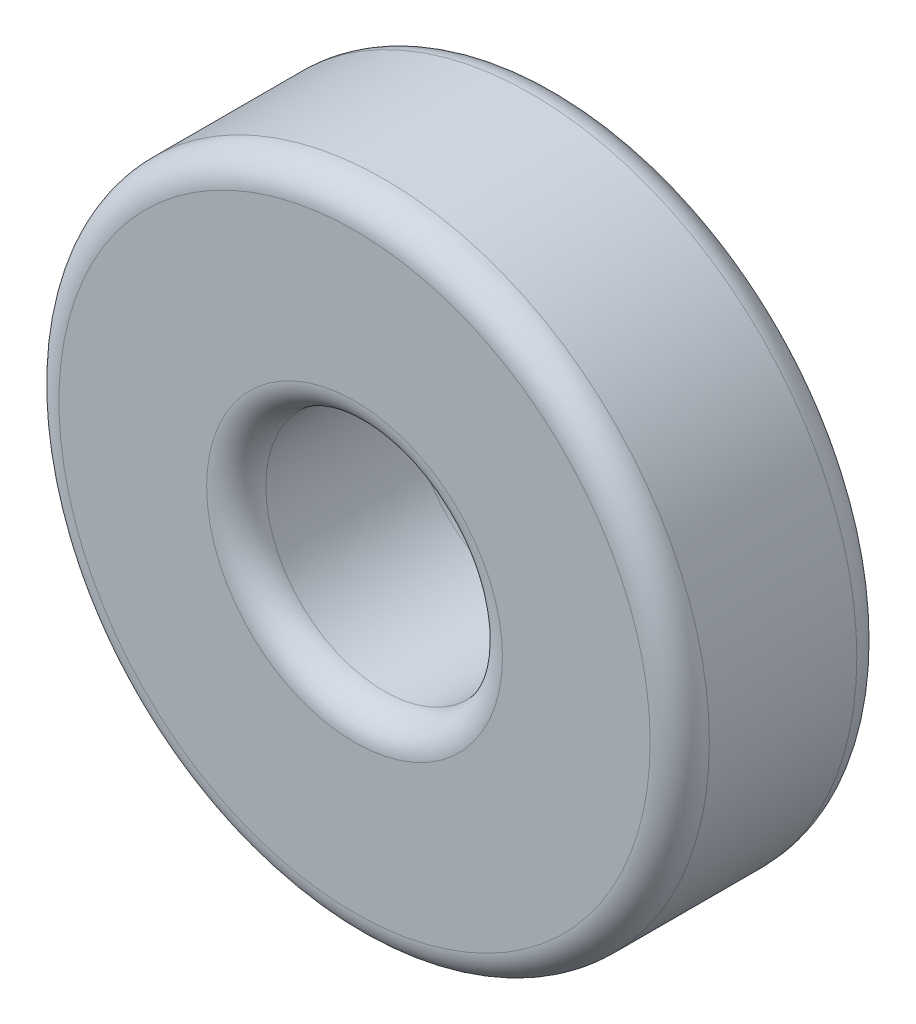
ISO-10303-21;
HEADER;
FILE_DESCRIPTION(('STEP AP214'),'2;1');
FILE_NAME('part.step','',(''),(''),'','','');
FILE_SCHEMA(('AUTOMOTIVE_DESIGN { 1 0 10303 214 1 1 1 1 }'));
ENDSEC;
DATA;
#1=APPLICATION_CONTEXT('core data for automotive mechanical design processes');
#2=APPLICATION_PROTOCOL_DEFINITION('international standard','automotive_design',2000,#1);
#3=PRODUCT_CONTEXT('',#1,'mechanical');
#4=PRODUCT('Part','Part','',(#3));
#5=PRODUCT_RELATED_PRODUCT_CATEGORY('part','',(#4));
#6=PRODUCT_DEFINITION_FORMATION('','',#4);
#7=PRODUCT_DEFINITION_CONTEXT('part definition',#1,'design');
#8=PRODUCT_DEFINITION('design','',#6,#7);
#9=PRODUCT_DEFINITION_SHAPE('','',#8);
#10=(LENGTH_UNIT() NAMED_UNIT(*) SI_UNIT(.MILLI.,.METRE.));
#11=(NAMED_UNIT(*) PLANE_ANGLE_UNIT() SI_UNIT($,.RADIAN.));
#12=(NAMED_UNIT(*) SI_UNIT($,.STERADIAN.) SOLID_ANGLE_UNIT());
#13=UNCERTAINTY_MEASURE_WITH_UNIT(LENGTH_MEASURE(1.E-05),#10,'distance_accuracy_value','');
#14=(GEOMETRIC_REPRESENTATION_CONTEXT(3) GLOBAL_UNCERTAINTY_ASSIGNED_CONTEXT((#13)) GLOBAL_UNIT_ASSIGNED_CONTEXT((#10,
#11,#12)) REPRESENTATION_CONTEXT('',''));
#15=CARTESIAN_POINT('',(0.,0.,0.));
#16=DIRECTION('',(0.,0.,1.));
#17=DIRECTION('',(1.,0.,0.));
#18=AXIS2_PLACEMENT_3D('',#15,#16,#17);
#19=CARTESIAN_POINT('',(0.,0.,6.985));
#20=DIRECTION('',(0.,0.,1.));
#21=DIRECTION('',(1.,0.,0.));
#22=AXIS2_PLACEMENT_3D('',#19,#20,#21);
#23=PLANE('',#22);
#24=CARTESIAN_POINT('',(0.,0.,6.985));
#25=DIRECTION('',(0.,0.,1.));
#26=DIRECTION('',(1.,0.,0.));
#27=AXIS2_PLACEMENT_3D('',#24,#25,#26);
#28=CIRCLE('',#27,5.);
#29=CARTESIAN_POINT('',(5.,0.,6.985));
#30=VERTEX_POINT('',#29);
#31=EDGE_CURVE('E42',#30,#30,#28,.F.);
#32=ORIENTED_EDGE('',*,*,#31,.T.);
#33=EDGE_LOOP('',(#32));
#34=FACE_BOUND('',#33,.T.);
#35=CARTESIAN_POINT('',(0.,0.,6.985));
#36=DIRECTION('',(0.,0.,1.));
#37=DIRECTION('',(1.,0.,0.));
#38=AXIS2_PLACEMENT_3D('',#35,#36,#37);
#39=CIRCLE('',#38,9.99185);
#40=CARTESIAN_POINT('',(9.99185,0.,6.985));
#41=VERTEX_POINT('',#40);
#42=EDGE_CURVE('E46',#41,#41,#39,.T.);
#43=ORIENTED_EDGE('',*,*,#42,.T.);
#44=EDGE_LOOP('',(#43));
#45=FACE_BOUND('',#44,.T.);
#46=ADVANCED_FACE('F31',(#34,#45),#23,.T.);
#47=CARTESIAN_POINT('',(0.,0.,0.));
#48=DIRECTION('',(0.,0.,1.));
#49=DIRECTION('',(1.,0.,0.));
#50=AXIS2_PLACEMENT_3D('',#47,#48,#49);
#51=PLANE('',#50);
#52=CARTESIAN_POINT('',(0.,0.,0.));
#53=DIRECTION('',(0.,0.,1.));
#54=DIRECTION('',(1.,0.,0.));
#55=AXIS2_PLACEMENT_3D('',#52,#53,#54);
#56=CIRCLE('',#55,5.);
#57=CARTESIAN_POINT('',(5.,0.,0.));
#58=VERTEX_POINT('',#57);
#59=EDGE_CURVE('E57',#58,#58,#56,.T.);
#60=ORIENTED_EDGE('',*,*,#59,.T.);
#61=EDGE_LOOP('',(#60));
#62=FACE_BOUND('',#61,.T.);
#63=CARTESIAN_POINT('',(0.,0.,0.));
#64=DIRECTION('',(0.,0.,1.));
#65=DIRECTION('',(1.,0.,0.));
#66=AXIS2_PLACEMENT_3D('',#63,#64,#65);
#67=CIRCLE('',#66,9.99185);
#68=CARTESIAN_POINT('',(9.99185,0.,0.));
#69=VERTEX_POINT('',#68);
#70=EDGE_CURVE('E60',#69,#69,#67,.F.);
#71=ORIENTED_EDGE('',*,*,#70,.T.);
#72=EDGE_LOOP('',(#71));
#73=FACE_BOUND('',#72,.T.);
#74=ADVANCED_FACE('F64',(#62,#73),#51,.F.);
#75=CARTESIAN_POINT('',(0.,0.,6.985));
#76=DIRECTION('',(0.,0.,-1.));
#77=DIRECTION('',(-1.,0.,0.));
#78=AXIS2_PLACEMENT_3D('',#75,#76,#77);
#79=CYLINDRICAL_SURFACE('',#78,10.99185);
#80=CARTESIAN_POINT('',(0.,0.,1.));
#81=DIRECTION('',(0.,0.,1.));
#82=DIRECTION('',(1.,0.,0.));
#83=AXIS2_PLACEMENT_3D('',#80,#81,#82);
#84=CIRCLE('',#83,10.99185);
#85=CARTESIAN_POINT('',(10.99185,0.,1.));
#86=VERTEX_POINT('',#85);
#87=EDGE_CURVE('E10',#86,#86,#84,.T.);
#88=ORIENTED_EDGE('',*,*,#87,.T.);
#89=EDGE_LOOP('',(#88));
#90=FACE_BOUND('',#89,.T.);
#91=CARTESIAN_POINT('',(0.,0.,5.985));
#92=DIRECTION('',(0.,0.,1.));
#93=DIRECTION('',(1.,0.,0.));
#94=AXIS2_PLACEMENT_3D('',#91,#92,#93);
#95=CIRCLE('',#94,10.99185);
#96=CARTESIAN_POINT('',(10.99185,0.,5.985));
#97=VERTEX_POINT('',#96);
#98=EDGE_CURVE('E38',#97,#97,#95,.F.);
#99=ORIENTED_EDGE('',*,*,#98,.T.);
#100=EDGE_LOOP('',(#99));
#101=FACE_BOUND('',#100,.T.);
#102=ADVANCED_FACE('F84',(#90,#101),#79,.T.);
#103=CARTESIAN_POINT('',(0.,0.,6.985));
#104=DIRECTION('',(0.,0.,-1.));
#105=DIRECTION('',(-1.,0.,0.));
#106=AXIS2_PLACEMENT_3D('',#103,#104,#105);
#107=CYLINDRICAL_SURFACE('',#106,4.);
#108=CARTESIAN_POINT('',(0.,0.,1.));
#109=DIRECTION('',(0.,0.,1.));
#110=DIRECTION('',(1.,0.,0.));
#111=AXIS2_PLACEMENT_3D('',#108,#109,#110);
#112=CIRCLE('',#111,4.);
#113=CARTESIAN_POINT('',(4.,0.,1.));
#114=VERTEX_POINT('',#113);
#115=EDGE_CURVE('E51',#114,#114,#112,.F.);
#116=ORIENTED_EDGE('',*,*,#115,.T.);
#117=EDGE_LOOP('',(#116));
#118=FACE_BOUND('',#117,.T.);
#119=CARTESIAN_POINT('',(0.,0.,5.985));
#120=DIRECTION('',(0.,0.,1.));
#121=DIRECTION('',(1.,0.,0.));
#122=AXIS2_PLACEMENT_3D('',#119,#120,#121);
#123=CIRCLE('',#122,4.);
#124=CARTESIAN_POINT('',(4.,0.,5.985));
#125=VERTEX_POINT('',#124);
#126=EDGE_CURVE('E54',#125,#125,#123,.T.);
#127=ORIENTED_EDGE('',*,*,#126,.T.);
#128=EDGE_LOOP('',(#127));
#129=FACE_BOUND('',#128,.T.);
#130=ADVANCED_FACE('F89',(#118,#129),#107,.F.);
#131=CARTESIAN_POINT('',(0.,0.,1.));
#132=DIRECTION('',(0.,0.,1.));
#133=DIRECTION('',(1.,0.,0.));
#134=AXIS2_PLACEMENT_3D('',#131,#132,#133);
#135=TOROIDAL_SURFACE('',#134,5.,1.);
#136=ORIENTED_EDGE('',*,*,#115,.F.);
#137=EDGE_LOOP('',(#136));
#138=FACE_BOUND('',#137,.T.);
#139=ORIENTED_EDGE('',*,*,#59,.F.);
#140=EDGE_LOOP('',(#139));
#141=FACE_BOUND('',#140,.T.);
#142=ADVANCED_FACE('F75',(#138,#141),#135,.T.);
#143=CARTESIAN_POINT('',(0.,0.,5.985));
#144=DIRECTION('',(0.,0.,1.));
#145=DIRECTION('',(1.,0.,0.));
#146=AXIS2_PLACEMENT_3D('',#143,#144,#145);
#147=TOROIDAL_SURFACE('',#146,5.,1.);
#148=ORIENTED_EDGE('',*,*,#31,.F.);
#149=EDGE_LOOP('',(#148));
#150=FACE_BOUND('',#149,.T.);
#151=ORIENTED_EDGE('',*,*,#126,.F.);
#152=EDGE_LOOP('',(#151));
#153=FACE_BOUND('',#152,.T.);
#154=ADVANCED_FACE('F69',(#150,#153),#147,.T.);
#155=CARTESIAN_POINT('',(0.,0.,1.));
#156=DIRECTION('',(0.,0.,1.));
#157=DIRECTION('',(1.,0.,0.));
#158=AXIS2_PLACEMENT_3D('',#155,#156,#157);
#159=TOROIDAL_SURFACE('',#158,9.99185,1.);
#160=ORIENTED_EDGE('',*,*,#70,.F.);
#161=EDGE_LOOP('',(#160));
#162=FACE_BOUND('',#161,.T.);
#163=ORIENTED_EDGE('',*,*,#87,.F.);
#164=EDGE_LOOP('',(#163));
#165=FACE_BOUND('',#164,.T.);
#166=ADVANCED_FACE('F66',(#162,#165),#159,.T.);
#167=CARTESIAN_POINT('',(0.,0.,5.985));
#168=DIRECTION('',(0.,0.,1.));
#169=DIRECTION('',(1.,0.,0.));
#170=AXIS2_PLACEMENT_3D('',#167,#168,#169);
#171=TOROIDAL_SURFACE('',#170,9.99185,1.);
#172=ORIENTED_EDGE('',*,*,#98,.F.);
#173=EDGE_LOOP('',(#172));
#174=FACE_BOUND('',#173,.T.);
#175=ORIENTED_EDGE('',*,*,#42,.F.);
#176=EDGE_LOOP('',(#175));
#177=FACE_BOUND('',#176,.T.);
#178=ADVANCED_FACE('F33',(#174,#177),#171,.T.);
#179=CLOSED_SHELL('',(#46,#74,#102,#130,#142,#154,#166,#178));
#180=MANIFOLD_SOLID_BREP('B2',#179);
#181=ADVANCED_BREP_SHAPE_REPRESENTATION('',(#18,#180),#14);
#182=SHAPE_DEFINITION_REPRESENTATION(#9,#181);
ENDSEC;
END-ISO-10303-21;
